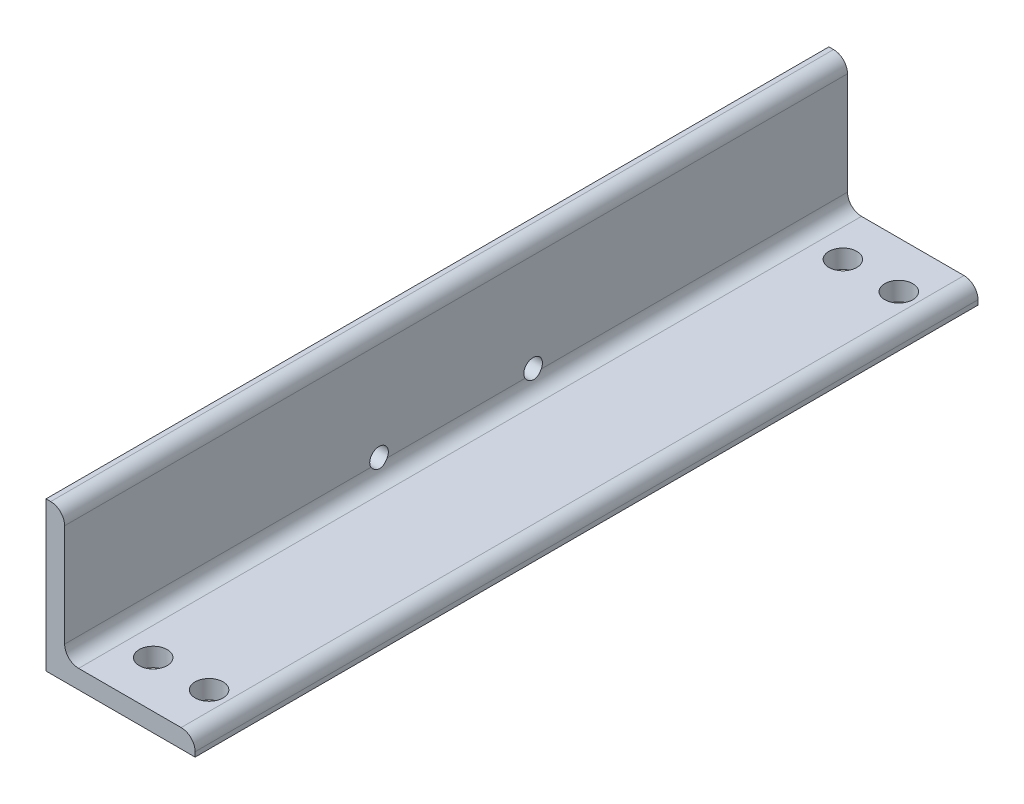
ISO-10303-21;
HEADER;
FILE_DESCRIPTION(('STEP AP214'),'2;1');
FILE_NAME('part.step','',(''),(''),'','','');
FILE_SCHEMA(('AUTOMOTIVE_DESIGN { 1 0 10303 214 1 1 1 1 }'));
ENDSEC;
DATA;
#1=APPLICATION_CONTEXT('core data for automotive mechanical design processes');
#2=APPLICATION_PROTOCOL_DEFINITION('international standard','automotive_design',2000,#1);
#3=PRODUCT_CONTEXT('',#1,'mechanical');
#4=PRODUCT('Part','Part','',(#3));
#5=PRODUCT_RELATED_PRODUCT_CATEGORY('part','',(#4));
#6=PRODUCT_DEFINITION_FORMATION('','',#4);
#7=PRODUCT_DEFINITION_CONTEXT('part definition',#1,'design');
#8=PRODUCT_DEFINITION('design','',#6,#7);
#9=PRODUCT_DEFINITION_SHAPE('','',#8);
#10=(LENGTH_UNIT() NAMED_UNIT(*) SI_UNIT(.MILLI.,.METRE.));
#11=(NAMED_UNIT(*) PLANE_ANGLE_UNIT() SI_UNIT($,.RADIAN.));
#12=(NAMED_UNIT(*) SI_UNIT($,.STERADIAN.) SOLID_ANGLE_UNIT());
#13=UNCERTAINTY_MEASURE_WITH_UNIT(LENGTH_MEASURE(1.E-05),#10,'distance_accuracy_value','');
#14=(GEOMETRIC_REPRESENTATION_CONTEXT(3) GLOBAL_UNCERTAINTY_ASSIGNED_CONTEXT((#13)) GLOBAL_UNIT_ASSIGNED_CONTEXT((#10,
#11,#12)) REPRESENTATION_CONTEXT('',''));
#15=CARTESIAN_POINT('',(0.,0.,0.));
#16=DIRECTION('',(0.,0.,1.));
#17=DIRECTION('',(1.,0.,0.));
#18=AXIS2_PLACEMENT_3D('',#15,#16,#17);
#19=CARTESIAN_POINT('',(101.6,0.,266.7));
#20=DIRECTION('',(0.,1.,0.));
#21=DIRECTION('',(-1.,0.,0.));
#22=AXIS2_PLACEMENT_3D('',#19,#20,#21);
#23=PLANE('',#22);
#24=CARTESIAN_POINT('',(79.375,0.,-234.95));
#25=DIRECTION('',(0.,1.,0.));
#26=DIRECTION('',(-1.,0.,0.));
#27=AXIS2_PLACEMENT_3D('',#24,#25,#26);
#28=CIRCLE('',#27,9.525);
#29=CARTESIAN_POINT('',(69.85,0.,-234.95));
#30=VERTEX_POINT('',#29);
#31=EDGE_CURVE('E195',#30,#30,#28,.F.);
#32=ORIENTED_EDGE('',*,*,#31,.F.);
#33=EDGE_LOOP('',(#32));
#34=FACE_BOUND('',#33,.T.);
#35=CARTESIAN_POINT('',(79.375,0.,234.95));
#36=DIRECTION('',(0.,1.,0.));
#37=DIRECTION('',(-1.,0.,0.));
#38=AXIS2_PLACEMENT_3D('',#35,#36,#37);
#39=CIRCLE('',#38,9.525);
#40=CARTESIAN_POINT('',(69.85,0.,234.95));
#41=VERTEX_POINT('',#40);
#42=EDGE_CURVE('E189',#41,#41,#39,.F.);
#43=ORIENTED_EDGE('',*,*,#42,.F.);
#44=EDGE_LOOP('',(#43));
#45=FACE_BOUND('',#44,.T.);
#46=CARTESIAN_POINT('',(41.275,0.,234.95));
#47=DIRECTION('',(0.,1.,0.));
#48=DIRECTION('',(-1.,0.,0.));
#49=AXIS2_PLACEMENT_3D('',#46,#47,#48);
#50=CIRCLE('',#49,9.525);
#51=CARTESIAN_POINT('',(31.75,0.,234.95));
#52=VERTEX_POINT('',#51);
#53=EDGE_CURVE('E183',#52,#52,#50,.F.);
#54=ORIENTED_EDGE('',*,*,#53,.F.);
#55=EDGE_LOOP('',(#54));
#56=FACE_BOUND('',#55,.T.);
#57=CARTESIAN_POINT('',(41.275,0.,-234.95));
#58=DIRECTION('',(0.,1.,0.));
#59=DIRECTION('',(-1.,0.,0.));
#60=AXIS2_PLACEMENT_3D('',#57,#58,#59);
#61=CIRCLE('',#60,9.525);
#62=CARTESIAN_POINT('',(31.75,0.,-234.95));
#63=VERTEX_POINT('',#62);
#64=EDGE_CURVE('E161',#63,#63,#61,.F.);
#65=ORIENTED_EDGE('',*,*,#64,.F.);
#66=EDGE_LOOP('',(#65));
#67=FACE_BOUND('',#66,.T.);
#68=DIRECTION('',(1.,0.,0.));
#69=VECTOR('',#68,1.);
#70=CARTESIAN_POINT('',(101.6,0.,-266.7));
#71=LINE('',#70,#69);
#72=CARTESIAN_POINT('',(0.,0.,-266.7));
#73=VERTEX_POINT('',#72);
#74=CARTESIAN_POINT('',(101.6,0.,-266.7));
#75=VERTEX_POINT('',#74);
#76=EDGE_CURVE('E158',#73,#75,#71,.T.);
#77=ORIENTED_EDGE('',*,*,#76,.T.);
#78=DIRECTION('',(0.,0.,-1.));
#79=VECTOR('',#78,1.);
#80=CARTESIAN_POINT('',(101.6,0.,266.7));
#81=LINE('',#80,#79);
#82=CARTESIAN_POINT('',(101.6,0.,266.7));
#83=VERTEX_POINT('',#82);
#84=EDGE_CURVE('E11',#83,#75,#81,.T.);
#85=ORIENTED_EDGE('',*,*,#84,.F.);
#86=DIRECTION('',(1.,0.,0.));
#87=VECTOR('',#86,1.);
#88=CARTESIAN_POINT('',(101.6,0.,266.7));
#89=LINE('',#88,#87);
#90=CARTESIAN_POINT('',(0.,0.,266.7));
#91=VERTEX_POINT('',#90);
#92=EDGE_CURVE('E143',#91,#83,#89,.T.);
#93=ORIENTED_EDGE('',*,*,#92,.F.);
#94=DIRECTION('',(0.,0.,-1.));
#95=VECTOR('',#94,1.);
#96=CARTESIAN_POINT('',(0.,0.,266.7));
#97=LINE('',#96,#95);
#98=EDGE_CURVE('E137',#91,#73,#97,.T.);
#99=ORIENTED_EDGE('',*,*,#98,.T.);
#100=EDGE_LOOP('',(#77,#85,#93,#99));
#101=FACE_BOUND('',#100,.T.);
#102=ADVANCED_FACE('F17',(#34,#45,#56,#67,#101),#23,.F.);
#103=CARTESIAN_POINT('',(101.6,3.18008,266.7));
#104=DIRECTION('',(-1.,0.,0.));
#105=DIRECTION('',(0.,0.,1.));
#106=AXIS2_PLACEMENT_3D('',#103,#104,#105);
#107=PLANE('',#106);
#108=DIRECTION('',(0.,1.,0.));
#109=VECTOR('',#108,1.);
#110=CARTESIAN_POINT('',(101.6,3.18008,-266.7));
#111=LINE('',#110,#109);
#112=CARTESIAN_POINT('',(101.6,3.18008,-266.7));
#113=VERTEX_POINT('',#112);
#114=EDGE_CURVE('E156',#75,#113,#111,.T.);
#115=ORIENTED_EDGE('',*,*,#114,.T.);
#116=DIRECTION('',(0.,0.,-1.));
#117=VECTOR('',#116,1.);
#118=CARTESIAN_POINT('',(101.6,3.18008,266.7));
#119=LINE('',#118,#117);
#120=CARTESIAN_POINT('',(101.6,3.18008,266.7));
#121=VERTEX_POINT('',#120);
#122=EDGE_CURVE('E24',#121,#113,#119,.T.);
#123=ORIENTED_EDGE('',*,*,#122,.F.);
#124=DIRECTION('',(0.,1.,0.));
#125=VECTOR('',#124,1.);
#126=CARTESIAN_POINT('',(101.6,3.18008,266.7));
#127=LINE('',#126,#125);
#128=EDGE_CURVE('E174',#83,#121,#127,.T.);
#129=ORIENTED_EDGE('',*,*,#128,.F.);
#130=ORIENTED_EDGE('',*,*,#84,.T.);
#131=EDGE_LOOP('',(#115,#123,#129,#130));
#132=FACE_BOUND('',#131,.T.);
#133=ADVANCED_FACE('F253',(#132),#107,.F.);
#134=CARTESIAN_POINT('',(92.08008,3.18008,266.7));
#135=DIRECTION('',(0.,0.,-1.));
#136=DIRECTION('',(-1.,0.,0.));
#137=AXIS2_PLACEMENT_3D('',#134,#135,#136);
#138=CYLINDRICAL_SURFACE('',#137,9.51992);
#139=CARTESIAN_POINT('',(92.08008,3.18008,-266.7));
#140=DIRECTION('',(0.,0.,1.));
#141=DIRECTION('',(1.,0.,0.));
#142=AXIS2_PLACEMENT_3D('',#139,#140,#141);
#143=CIRCLE('',#142,9.51992);
#144=CARTESIAN_POINT('',(92.08008,12.7,-266.7));
#145=VERTEX_POINT('',#144);
#146=EDGE_CURVE('E154',#113,#145,#143,.T.);
#147=ORIENTED_EDGE('',*,*,#146,.T.);
#148=DIRECTION('',(0.,0.,-1.));
#149=VECTOR('',#148,1.);
#150=CARTESIAN_POINT('',(92.08008,12.7,266.7));
#151=LINE('',#150,#149);
#152=CARTESIAN_POINT('',(92.08008,12.7,266.7));
#153=VERTEX_POINT('',#152);
#154=EDGE_CURVE('E120',#153,#145,#151,.T.);
#155=ORIENTED_EDGE('',*,*,#154,.F.);
#156=CARTESIAN_POINT('',(92.08008,3.18008,266.7));
#157=DIRECTION('',(0.,0.,1.));
#158=DIRECTION('',(1.,0.,0.));
#159=AXIS2_PLACEMENT_3D('',#156,#157,#158);
#160=CIRCLE('',#159,9.51992);
#161=EDGE_CURVE('E172',#121,#153,#160,.T.);
#162=ORIENTED_EDGE('',*,*,#161,.F.);
#163=ORIENTED_EDGE('',*,*,#122,.T.);
#164=EDGE_LOOP('',(#147,#155,#162,#163));
#165=FACE_BOUND('',#164,.T.);
#166=ADVANCED_FACE('F249',(#165),#138,.T.);
#167=CARTESIAN_POINT('',(22.225,12.7,266.7));
#168=DIRECTION('',(0.,-1.,0.));
#169=DIRECTION('',(1.,0.,0.));
#170=AXIS2_PLACEMENT_3D('',#167,#168,#169);
#171=PLANE('',#170);
#172=CARTESIAN_POINT('',(79.375,12.7,-234.95));
#173=DIRECTION('',(0.,1.,0.));
#174=DIRECTION('',(1.,0.,0.));
#175=AXIS2_PLACEMENT_3D('',#172,#173,#174);
#176=CIRCLE('',#175,9.525);
#177=CARTESIAN_POINT('',(88.9,12.7,-234.95));
#178=VERTEX_POINT('',#177);
#179=EDGE_CURVE('E198',#178,#178,#176,.T.);
#180=ORIENTED_EDGE('',*,*,#179,.F.);
#181=EDGE_LOOP('',(#180));
#182=FACE_BOUND('',#181,.T.);
#183=CARTESIAN_POINT('',(79.375,12.7,234.95));
#184=DIRECTION('',(0.,1.,0.));
#185=DIRECTION('',(-1.,0.,0.));
#186=AXIS2_PLACEMENT_3D('',#183,#184,#185);
#187=CIRCLE('',#186,9.525);
#188=CARTESIAN_POINT('',(69.85,12.7,234.95));
#189=VERTEX_POINT('',#188);
#190=EDGE_CURVE('E192',#189,#189,#187,.T.);
#191=ORIENTED_EDGE('',*,*,#190,.F.);
#192=EDGE_LOOP('',(#191));
#193=FACE_BOUND('',#192,.T.);
#194=CARTESIAN_POINT('',(41.275,12.7,234.95));
#195=DIRECTION('',(0.,1.,0.));
#196=DIRECTION('',(1.,0.,0.));
#197=AXIS2_PLACEMENT_3D('',#194,#195,#196);
#198=CIRCLE('',#197,9.525);
#199=CARTESIAN_POINT('',(50.8,12.7,234.95));
#200=VERTEX_POINT('',#199);
#201=EDGE_CURVE('E186',#200,#200,#198,.T.);
#202=ORIENTED_EDGE('',*,*,#201,.F.);
#203=EDGE_LOOP('',(#202));
#204=FACE_BOUND('',#203,.T.);
#205=CARTESIAN_POINT('',(41.275,12.7,-234.95));
#206=DIRECTION('',(0.,1.,0.));
#207=DIRECTION('',(-1.,0.,0.));
#208=AXIS2_PLACEMENT_3D('',#205,#206,#207);
#209=CIRCLE('',#208,9.525);
#210=CARTESIAN_POINT('',(31.75,12.7,-234.95));
#211=VERTEX_POINT('',#210);
#212=EDGE_CURVE('E180',#211,#211,#209,.T.);
#213=ORIENTED_EDGE('',*,*,#212,.F.);
#214=EDGE_LOOP('',(#213));
#215=FACE_BOUND('',#214,.T.);
#216=DIRECTION('',(-1.,0.,0.));
#217=VECTOR('',#216,1.);
#218=CARTESIAN_POINT('',(22.225,12.7,-266.7));
#219=LINE('',#218,#217);
#220=CARTESIAN_POINT('',(22.225,12.7,-266.7));
#221=VERTEX_POINT('',#220);
#222=EDGE_CURVE('E152',#145,#221,#219,.T.);
#223=ORIENTED_EDGE('',*,*,#222,.T.);
#224=DIRECTION('',(0.,0.,-1.));
#225=VECTOR('',#224,1.);
#226=CARTESIAN_POINT('',(22.225,12.7,266.7));
#227=LINE('',#226,#225);
#228=CARTESIAN_POINT('',(22.225,12.7,266.7));
#229=VERTEX_POINT('',#228);
#230=EDGE_CURVE('E116',#229,#221,#227,.T.);
#231=ORIENTED_EDGE('',*,*,#230,.F.);
#232=DIRECTION('',(-1.,0.,0.));
#233=VECTOR('',#232,1.);
#234=CARTESIAN_POINT('',(22.225,12.7,266.7));
#235=LINE('',#234,#233);
#236=EDGE_CURVE('E170',#153,#229,#235,.T.);
#237=ORIENTED_EDGE('',*,*,#236,.F.);
#238=ORIENTED_EDGE('',*,*,#154,.T.);
#239=EDGE_LOOP('',(#223,#231,#237,#238));
#240=FACE_BOUND('',#239,.T.);
#241=ADVANCED_FACE('F245',(#182,#193,#204,#215,#240),#171,.F.);
#242=CARTESIAN_POINT('',(22.225,22.225,266.7));
#243=DIRECTION('',(0.,0.,-1.));
#244=DIRECTION('',(-1.,0.,0.));
#245=AXIS2_PLACEMENT_3D('',#242,#243,#244);
#246=CYLINDRICAL_SURFACE('',#245,9.525);
#247=DIRECTION('',(0.,0.,-1.));
#248=VECTOR('',#247,1.);
#249=CARTESIAN_POINT('',(12.7,22.225,266.7));
#250=LINE('',#249,#248);
#251=CARTESIAN_POINT('',(12.7,22.225,46.9898386859688));
#252=VERTEX_POINT('',#251);
#253=CARTESIAN_POINT('',(12.7,22.225,-46.9898386859688));
#254=VERTEX_POINT('',#253);
#255=EDGE_CURVE('E110',#252,#254,#250,.T.);
#256=ORIENTED_EDGE('',*,*,#255,.F.);
#257=CARTESIAN_POINT('',(12.7,22.225,57.9883613140312));
#258=CARTESIAN_POINT('',(12.6999827797198,22.073747023169,57.9010652201356));
#259=CARTESIAN_POINT('',(12.7036020266311,21.9261666695694,57.8075126623455));
#260=CARTESIAN_POINT('',(12.7169364482523,21.6394724254637,57.6087916880467));
#261=CARTESIAN_POINT('',(12.7266475791581,21.5003529857331,57.5036310151549));
#262=CARTESIAN_POINT('',(12.750958155591,21.2318706006449,57.2827790052492));
#263=CARTESIAN_POINT('',(12.7655439948094,21.1024817133119,57.1671176251949));
#264=CARTESIAN_POINT('',(12.798377928773,20.8538152379376,56.9258460242172));
#265=CARTESIAN_POINT('',(12.8166265898387,20.7345392175398,56.8002342666547));
#266=CARTESIAN_POINT('',(12.8554966806538,20.5070584428926,56.540198978187));
#267=CARTESIAN_POINT('',(12.8761128381699,20.3988300647512,56.4057953030353));
#268=CARTESIAN_POINT('',(12.9185263814264,20.1937077958268,56.1287078060163));
#269=CARTESIAN_POINT('',(12.9403241689367,20.0968177960641,55.9860211666475));
#270=CARTESIAN_POINT('',(12.9839042072899,19.9149071167127,55.6931579148723));
#271=CARTESIAN_POINT('',(13.0056864428088,19.8298930504997,55.5429771918946));
#272=CARTESIAN_POINT('',(13.0480696077046,19.6723085952029,55.2360634666354));
#273=CARTESIAN_POINT('',(13.0686705459691,19.5997381124906,55.0793305136655));
#274=CARTESIAN_POINT('',(13.1084371762002,19.4647334353171,54.7534986760388));
#275=CARTESIAN_POINT('',(13.1275058271347,19.4028551354978,54.5841570080991));
#276=CARTESIAN_POINT('',(13.1621000716123,19.2936601731414,54.2405554814189));
#277=CARTESIAN_POINT('',(13.1776270141683,19.2463379638851,54.0662975237747));
#278=CARTESIAN_POINT('',(13.2042460989573,19.1666685130754,53.7141143642797));
#279=CARTESIAN_POINT('',(13.2153397547297,19.134316160165,53.5361904358562));
#280=CARTESIAN_POINT('',(13.2324460824723,19.0848905322721,53.1779933638632));
#281=CARTESIAN_POINT('',(13.2384590349304,19.0678164138286,52.9977203505363));
#282=CARTESIAN_POINT('',(13.2449047015103,19.0495315458891,52.6441047809365));
#283=CARTESIAN_POINT('',(13.2455676813632,19.0476661661744,52.4707999822137));
#284=CARTESIAN_POINT('',(13.2418817508243,19.058102036211,52.1246741779014));
#285=CARTESIAN_POINT('',(13.2375329652902,19.0704029330389,51.9518531603668));
#286=CARTESIAN_POINT('',(13.2240617329295,19.1090488693273,51.6079804584642));
#287=CARTESIAN_POINT('',(13.2149392563347,19.1353939963659,51.4369287851363));
#288=CARTESIAN_POINT('',(13.1924145874921,19.2018799599007,51.097818829635));
#289=CARTESIAN_POINT('',(13.179012369901,19.2420208780908,50.9297605651938));
#290=CARTESIAN_POINT('',(13.1489414832537,19.3348245533895,50.6010485624637));
#291=CARTESIAN_POINT('',(13.1323423995837,19.3872249217998,50.4403141695282));
#292=CARTESIAN_POINT('',(13.09654646157,19.5045731325473,50.1237351278395));
#293=CARTESIAN_POINT('',(13.0773487466099,19.5695251348039,49.9678921201718));
#294=CARTESIAN_POINT('',(13.0373033169677,19.7115759448712,49.6619466657816));
#295=CARTESIAN_POINT('',(13.0164545660346,19.7886824118256,49.5118479134289));
#296=CARTESIAN_POINT('',(12.9741618627834,19.9545503138604,49.2183206012311));
#297=CARTESIAN_POINT('',(12.9527178920628,20.0433121096079,49.0748922479836));
#298=CARTESIAN_POINT('',(12.9091267176458,20.2373942526399,48.7875116740178));
#299=CARTESIAN_POINT('',(12.8870092961105,20.3433707692314,48.6439973630534));
#300=CARTESIAN_POINT('',(12.8446977357167,20.5671365603043,48.3662709902861));
#301=CARTESIAN_POINT('',(12.8245029073061,20.684921568229,48.2320555980955));
#302=CARTESIAN_POINT('',(12.7874276417262,20.9314165936432,47.9740092378239));
#303=CARTESIAN_POINT('',(12.770541517766,21.0601073117669,47.8501606656117));
#304=CARTESIAN_POINT('',(12.7414041834692,21.3277095254071,47.613567490968));
#305=CARTESIAN_POINT('',(12.7291502409881,21.4666149381728,47.5008163721771));
#306=CARTESIAN_POINT('',(12.7134994081993,21.7085613726005,47.3208477880985));
#307=CARTESIAN_POINT('',(12.7085293033237,21.8091554322337,47.2504558963998));
#308=CARTESIAN_POINT('',(12.7017790449912,22.0142331751443,47.1156334058616));
#309=CARTESIAN_POINT('',(12.6999960275457,22.1187132800441,47.051197504272));
#310=CARTESIAN_POINT('',(12.7,22.225,46.9898386859688));
#311=B_SPLINE_CURVE_WITH_KNOTS('',3,(#257,#258,#259,#260,#261,#262,#263,#264,#265,#266,#267,
#268,#269,#270,#271,#272,#273,#274,#275,#276,#277,#278,#279,#280,#281,#282,#283,#284,#285,#286,
#287,#288,#289,#290,#291,#292,#293,#294,#295,#296,#297,#298,#299,#300,#301,#302,#303,#304,#305,
#306,#307,#308,#309,#310),.UNSPECIFIED.,.F.,.F.,(4,2,2,2,2,2,2,2,2,2,2,2,2,2,2,2,2,2,2,2,2,2,2,
2,2,2,4),(0.,0.523647527244092,1.04694782355641,1.56879951356917,2.09073195095311,
2.61152383605138,3.13249392175966,3.65375297441763,4.17500810482934,4.71822515052255,
5.26123494167952,5.80405918872557,6.34685346638268,6.86615386676682,7.38544133013575,
7.90473203175343,8.42402580848563,8.93308470454927,9.4423126054699,9.95186268900613,
10.4614285439838,11.0000966296267,11.5385707843629,12.0761111655917,12.6133339992296,
12.9817344318086,13.3498036447117),.UNSPECIFIED.);
#312=CARTESIAN_POINT('',(12.7,22.225,57.9883613140312));
#313=VERTEX_POINT('',#312);
#314=EDGE_CURVE('E30',#313,#252,#311,.T.);
#315=ORIENTED_EDGE('',*,*,#314,.F.);
#316=CARTESIAN_POINT('',(12.7,22.225,266.7));
#317=VERTEX_POINT('',#316);
#318=EDGE_CURVE('E108',#317,#313,#250,.T.);
#319=ORIENTED_EDGE('',*,*,#318,.F.);
#320=CARTESIAN_POINT('',(22.225,22.225,266.7));
#321=DIRECTION('',(0.,0.,-1.));
#322=DIRECTION('',(-1.,0.,0.));
#323=AXIS2_PLACEMENT_3D('',#320,#321,#322);
#324=CIRCLE('',#323,9.525);
#325=EDGE_CURVE('E168',#229,#317,#324,.T.);
#326=ORIENTED_EDGE('',*,*,#325,.F.);
#327=ORIENTED_EDGE('',*,*,#230,.T.);
#328=CARTESIAN_POINT('',(22.225,22.225,-266.7));
#329=DIRECTION('',(0.,0.,-1.));
#330=DIRECTION('',(-1.,0.,0.));
#331=AXIS2_PLACEMENT_3D('',#328,#329,#330);
#332=CIRCLE('',#331,9.525);
#333=CARTESIAN_POINT('',(12.7,22.225,-266.7));
#334=VERTEX_POINT('',#333);
#335=EDGE_CURVE('E150',#221,#334,#332,.T.);
#336=ORIENTED_EDGE('',*,*,#335,.T.);
#337=CARTESIAN_POINT('',(12.7,22.225,-57.9883613140312));
#338=VERTEX_POINT('',#337);
#339=EDGE_CURVE('E118',#338,#334,#250,.T.);
#340=ORIENTED_EDGE('',*,*,#339,.F.);
#341=CARTESIAN_POINT('',(12.7,22.225,-46.9898386859688));
#342=CARTESIAN_POINT('',(12.6999827797198,22.073747023169,-47.0771347798644));
#343=CARTESIAN_POINT('',(12.7036020266311,21.9261666695694,-47.1706873376545));
#344=CARTESIAN_POINT('',(12.7169364482523,21.6394724254637,-47.3694083119533));
#345=CARTESIAN_POINT('',(12.7266475791581,21.5003529857331,-47.4745689848451));
#346=CARTESIAN_POINT('',(12.750958155591,21.2318706006448,-47.6954209947509));
#347=CARTESIAN_POINT('',(12.7655439948094,21.1024817133119,-47.8110823748051));
#348=CARTESIAN_POINT('',(12.798377928773,20.8538152379376,-48.0523539757828));
#349=CARTESIAN_POINT('',(12.8166265898388,20.7345392175398,-48.1779657333453));
#350=CARTESIAN_POINT('',(12.8554966806538,20.5070584428925,-48.438001021813));
#351=CARTESIAN_POINT('',(12.87611283817,20.3988300647512,-48.5724046969647));
#352=CARTESIAN_POINT('',(12.9185263814264,20.1937077958268,-48.8494921939837));
#353=CARTESIAN_POINT('',(12.9403241689368,20.0968177960641,-48.9921788333525));
#354=CARTESIAN_POINT('',(12.9839042072899,19.9149071167127,-49.2850420851278));
#355=CARTESIAN_POINT('',(13.0056864428088,19.8298930504997,-49.4352228081054));
#356=CARTESIAN_POINT('',(13.0480696077046,19.6723085952028,-49.7421365333646));
#357=CARTESIAN_POINT('',(13.0686705459691,19.5997381124906,-49.8988694863345));
#358=CARTESIAN_POINT('',(13.1084371762002,19.4647334353171,-50.2247013239612));
#359=CARTESIAN_POINT('',(13.1275058271347,19.4028551354978,-50.3940429919009));
#360=CARTESIAN_POINT('',(13.1621000716123,19.2936601731414,-50.7376445185811));
#361=CARTESIAN_POINT('',(13.1776270141683,19.2463379638851,-50.9119024762253));
#362=CARTESIAN_POINT('',(13.2042460989573,19.1666685130754,-51.2640856357203));
#363=CARTESIAN_POINT('',(13.2153397547297,19.134316160165,-51.4420095641438));
#364=CARTESIAN_POINT('',(13.2324460824723,19.0848905322721,-51.8002066361368));
#365=CARTESIAN_POINT('',(13.2384590349304,19.0678164138286,-51.9804796494637));
#366=CARTESIAN_POINT('',(13.2449047015103,19.0495315458891,-52.3340952190635));
#367=CARTESIAN_POINT('',(13.2455676813632,19.0476661661744,-52.5074000177863));
#368=CARTESIAN_POINT('',(13.2418817508243,19.0581020362111,-52.8535258220986));
#369=CARTESIAN_POINT('',(13.2375329652902,19.0704029330389,-53.0263468396332));
#370=CARTESIAN_POINT('',(13.2240617329295,19.1090488693273,-53.3702195415358));
#371=CARTESIAN_POINT('',(13.2149392563347,19.1353939963659,-53.5412712148637));
#372=CARTESIAN_POINT('',(13.1924145874921,19.2018799599007,-53.880381170365));
#373=CARTESIAN_POINT('',(13.179012369901,19.2420208780907,-54.0484394348062));
#374=CARTESIAN_POINT('',(13.1489414832537,19.3348245533895,-54.3771514375363));
#375=CARTESIAN_POINT('',(13.1323423995837,19.3872249217998,-54.5378858304718));
#376=CARTESIAN_POINT('',(13.09654646157,19.5045731325473,-54.8544648721604));
#377=CARTESIAN_POINT('',(13.0773487466099,19.5695251348039,-55.0103078798282));
#378=CARTESIAN_POINT('',(13.0373033169677,19.7115759448712,-55.3162533342184));
#379=CARTESIAN_POINT('',(13.0164545660346,19.7886824118256,-55.4663520865711));
#380=CARTESIAN_POINT('',(12.9741618627834,19.9545503138604,-55.7598793987689));
#381=CARTESIAN_POINT('',(12.9527178920628,20.0433121096079,-55.9033077520164));
#382=CARTESIAN_POINT('',(12.9091267176458,20.2373942526399,-56.1906883259822));
#383=CARTESIAN_POINT('',(12.8870092961105,20.3433707692314,-56.3342026369466));
#384=CARTESIAN_POINT('',(12.8446977357167,20.5671365603043,-56.6119290097139));
#385=CARTESIAN_POINT('',(12.8245029073061,20.684921568229,-56.7461444019045));
#386=CARTESIAN_POINT('',(12.7874276417262,20.9314165936432,-57.0041907621761));
#387=CARTESIAN_POINT('',(12.770541517766,21.0601073117669,-57.1280393343883));
#388=CARTESIAN_POINT('',(12.7414041834692,21.3277095254071,-57.364632509032));
#389=CARTESIAN_POINT('',(12.7291502409881,21.4666149381728,-57.4773836278229));
#390=CARTESIAN_POINT('',(12.7134994081993,21.7085613726005,-57.6573522119015));
#391=CARTESIAN_POINT('',(12.7085293033237,21.8091554322337,-57.7277441036002));
#392=CARTESIAN_POINT('',(12.7017790449912,22.0142331751444,-57.8625665941384));
#393=CARTESIAN_POINT('',(12.6999960275457,22.1187132800441,-57.927002495728));
#394=CARTESIAN_POINT('',(12.7,22.225,-57.9883613140312));
#395=B_SPLINE_CURVE_WITH_KNOTS('',3,(#341,#342,#343,#344,#345,#346,#347,#348,#349,#350,#351,
#352,#353,#354,#355,#356,#357,#358,#359,#360,#361,#362,#363,#364,#365,#366,#367,#368,#369,#370,
#371,#372,#373,#374,#375,#376,#377,#378,#379,#380,#381,#382,#383,#384,#385,#386,#387,#388,#389,
#390,#391,#392,#393,#394),.UNSPECIFIED.,.F.,.F.,(4,2,2,2,2,2,2,2,2,2,2,2,2,2,2,2,2,2,2,2,2,2,2,
2,2,2,4),(0.,0.523647527244111,1.04694782355644,1.5687995135692,2.09073195095315,
2.61152383605141,3.13249392175969,3.65375297441764,4.17500810482935,4.71822515052257,
5.26123494167953,5.80405918872559,6.34685346638269,6.86615386676682,7.38544133013575,
7.90473203175344,8.42402580848563,8.93308470454928,9.4423126054699,9.95186268900614,
10.4614285439838,11.0000966296267,11.5385707843629,12.0761111655917,12.6133339992296,
12.9817344318086,13.3498036447117),.UNSPECIFIED.);
#396=EDGE_CURVE('E37',#254,#338,#395,.T.);
#397=ORIENTED_EDGE('',*,*,#396,.F.);
#398=EDGE_LOOP('',(#256,#315,#319,#326,#327,#336,#340,#397));
#399=FACE_BOUND('',#398,.T.);
#400=ADVANCED_FACE('F106',(#399),#246,.F.);
#401=CARTESIAN_POINT('',(12.7,92.08008,266.7));
#402=DIRECTION('',(-1.,0.,0.));
#403=DIRECTION('',(0.,-1.,0.));
#404=AXIS2_PLACEMENT_3D('',#401,#402,#403);
#405=PLANE('',#404);
#406=ORIENTED_EDGE('',*,*,#318,.T.);
#407=CARTESIAN_POINT('',(12.7,25.4,52.4891));
#408=DIRECTION('',(-1.,0.,0.));
#409=DIRECTION('',(0.,-1.,0.));
#410=AXIS2_PLACEMENT_3D('',#407,#408,#409);
#411=CIRCLE('',#410,6.35);
#412=EDGE_CURVE('E97',#252,#313,#411,.F.);
#413=ORIENTED_EDGE('',*,*,#412,.F.);
#414=ORIENTED_EDGE('',*,*,#255,.T.);
#415=CARTESIAN_POINT('',(12.7,25.4,-52.4891));
#416=DIRECTION('',(-1.,0.,0.));
#417=DIRECTION('',(0.,-1.,0.));
#418=AXIS2_PLACEMENT_3D('',#415,#416,#417);
#419=CIRCLE('',#418,6.35);
#420=EDGE_CURVE('E207',#338,#254,#419,.F.);
#421=ORIENTED_EDGE('',*,*,#420,.F.);
#422=ORIENTED_EDGE('',*,*,#339,.T.);
#423=DIRECTION('',(0.,1.,0.));
#424=VECTOR('',#423,1.);
#425=CARTESIAN_POINT('',(12.7,92.08008,-266.7));
#426=LINE('',#425,#424);
#427=CARTESIAN_POINT('',(12.7,92.08008,-266.7));
#428=VERTEX_POINT('',#427);
#429=EDGE_CURVE('E148',#334,#428,#426,.T.);
#430=ORIENTED_EDGE('',*,*,#429,.T.);
#431=DIRECTION('',(0.,0.,-1.));
#432=VECTOR('',#431,1.);
#433=CARTESIAN_POINT('',(12.7,92.08008,266.7));
#434=LINE('',#433,#432);
#435=CARTESIAN_POINT('',(12.7,92.08008,266.7));
#436=VERTEX_POINT('',#435);
#437=EDGE_CURVE('E123',#436,#428,#434,.T.);
#438=ORIENTED_EDGE('',*,*,#437,.F.);
#439=DIRECTION('',(0.,1.,0.));
#440=VECTOR('',#439,1.);
#441=CARTESIAN_POINT('',(12.7,92.08008,266.7));
#442=LINE('',#441,#440);
#443=EDGE_CURVE('E115',#317,#436,#442,.T.);
#444=ORIENTED_EDGE('',*,*,#443,.F.);
#445=EDGE_LOOP('',(#406,#413,#414,#421,#422,#430,#438,#444));
#446=FACE_BOUND('',#445,.T.);
#447=ADVANCED_FACE('F113',(#446),#405,.F.);
#448=CARTESIAN_POINT('',(3.18008,92.08008,266.7));
#449=DIRECTION('',(0.,0.,-1.));
#450=DIRECTION('',(-1.,0.,0.));
#451=AXIS2_PLACEMENT_3D('',#448,#449,#450);
#452=CYLINDRICAL_SURFACE('',#451,9.51992);
#453=CARTESIAN_POINT('',(3.18008,92.08008,-266.7));
#454=DIRECTION('',(0.,0.,1.));
#455=DIRECTION('',(-1.,0.,0.));
#456=AXIS2_PLACEMENT_3D('',#453,#454,#455);
#457=CIRCLE('',#456,9.51992);
#458=CARTESIAN_POINT('',(3.18008,101.6,-266.7));
#459=VERTEX_POINT('',#458);
#460=EDGE_CURVE('E146',#428,#459,#457,.T.);
#461=ORIENTED_EDGE('',*,*,#460,.T.);
#462=DIRECTION('',(0.,0.,-1.));
#463=VECTOR('',#462,1.);
#464=CARTESIAN_POINT('',(3.18008,101.6,266.7));
#465=LINE('',#464,#463);
#466=CARTESIAN_POINT('',(3.18008,101.6,266.7));
#467=VERTEX_POINT('',#466);
#468=EDGE_CURVE('E127',#467,#459,#465,.T.);
#469=ORIENTED_EDGE('',*,*,#468,.F.);
#470=CARTESIAN_POINT('',(3.18008,92.08008,266.7));
#471=DIRECTION('',(0.,0.,1.));
#472=DIRECTION('',(-1.,0.,0.));
#473=AXIS2_PLACEMENT_3D('',#470,#471,#472);
#474=CIRCLE('',#473,9.51992);
#475=EDGE_CURVE('E165',#436,#467,#474,.T.);
#476=ORIENTED_EDGE('',*,*,#475,.F.);
#477=ORIENTED_EDGE('',*,*,#437,.T.);
#478=EDGE_LOOP('',(#461,#469,#476,#477));
#479=FACE_BOUND('',#478,.T.);
#480=ADVANCED_FACE('F235',(#479),#452,.T.);
#481=CARTESIAN_POINT('',(0.,101.6,266.7));
#482=DIRECTION('',(0.,-1.,0.));
#483=DIRECTION('',(0.,0.,-1.));
#484=AXIS2_PLACEMENT_3D('',#481,#482,#483);
#485=PLANE('',#484);
#486=DIRECTION('',(-1.,0.,0.));
#487=VECTOR('',#486,1.);
#488=CARTESIAN_POINT('',(0.,101.6,-266.7));
#489=LINE('',#488,#487);
#490=CARTESIAN_POINT('',(0.,101.6,-266.7));
#491=VERTEX_POINT('',#490);
#492=EDGE_CURVE('E144',#459,#491,#489,.T.);
#493=ORIENTED_EDGE('',*,*,#492,.T.);
#494=DIRECTION('',(0.,0.,-1.));
#495=VECTOR('',#494,1.);
#496=CARTESIAN_POINT('',(0.,101.6,266.7));
#497=LINE('',#496,#495);
#498=CARTESIAN_POINT('',(0.,101.6,266.7));
#499=VERTEX_POINT('',#498);
#500=EDGE_CURVE('E132',#499,#491,#497,.T.);
#501=ORIENTED_EDGE('',*,*,#500,.F.);
#502=DIRECTION('',(-1.,0.,0.));
#503=VECTOR('',#502,1.);
#504=CARTESIAN_POINT('',(0.,101.6,266.7));
#505=LINE('',#504,#503);
#506=EDGE_CURVE('E163',#467,#499,#505,.T.);
#507=ORIENTED_EDGE('',*,*,#506,.F.);
#508=ORIENTED_EDGE('',*,*,#468,.T.);
#509=EDGE_LOOP('',(#493,#501,#507,#508));
#510=FACE_BOUND('',#509,.T.);
#511=ADVANCED_FACE('F263',(#510),#485,.F.);
#512=CARTESIAN_POINT('',(0.,0.,266.7));
#513=DIRECTION('',(1.,0.,0.));
#514=DIRECTION('',(0.,0.,-1.));
#515=AXIS2_PLACEMENT_3D('',#512,#513,#514);
#516=PLANE('',#515);
#517=CARTESIAN_POINT('',(0.,25.4,52.4891));
#518=DIRECTION('',(-1.,0.,0.));
#519=DIRECTION('',(0.,0.,1.));
#520=AXIS2_PLACEMENT_3D('',#517,#518,#519);
#521=CIRCLE('',#520,6.35);
#522=CARTESIAN_POINT('',(0.,25.4,58.8391));
#523=VERTEX_POINT('',#522);
#524=EDGE_CURVE('E102',#523,#523,#521,.T.);
#525=ORIENTED_EDGE('',*,*,#524,.F.);
#526=EDGE_LOOP('',(#525));
#527=FACE_BOUND('',#526,.T.);
#528=CARTESIAN_POINT('',(0.,25.4,-52.4891));
#529=DIRECTION('',(-1.,0.,0.));
#530=DIRECTION('',(0.,0.,1.));
#531=AXIS2_PLACEMENT_3D('',#528,#529,#530);
#532=CIRCLE('',#531,6.35);
#533=CARTESIAN_POINT('',(0.,25.4,-46.1391));
#534=VERTEX_POINT('',#533);
#535=EDGE_CURVE('E111',#534,#534,#532,.T.);
#536=ORIENTED_EDGE('',*,*,#535,.F.);
#537=EDGE_LOOP('',(#536));
#538=FACE_BOUND('',#537,.T.);
#539=DIRECTION('',(0.,-1.,0.));
#540=VECTOR('',#539,1.);
#541=CARTESIAN_POINT('',(0.,0.,-266.7));
#542=LINE('',#541,#540);
#543=EDGE_CURVE('E141',#491,#73,#542,.T.);
#544=ORIENTED_EDGE('',*,*,#543,.T.);
#545=ORIENTED_EDGE('',*,*,#98,.F.);
#546=DIRECTION('',(0.,-1.,0.));
#547=VECTOR('',#546,1.);
#548=CARTESIAN_POINT('',(0.,0.,266.7));
#549=LINE('',#548,#547);
#550=EDGE_CURVE('E140',#499,#91,#549,.T.);
#551=ORIENTED_EDGE('',*,*,#550,.F.);
#552=ORIENTED_EDGE('',*,*,#500,.T.);
#553=EDGE_LOOP('',(#544,#545,#551,#552));
#554=FACE_BOUND('',#553,.T.);
#555=ADVANCED_FACE('F260',(#527,#538,#554),#516,.F.);
#556=CARTESIAN_POINT('',(3.18008,92.08008,266.7));
#557=DIRECTION('',(0.,0.,-1.));
#558=DIRECTION('',(-1.,0.,0.));
#559=AXIS2_PLACEMENT_3D('',#556,#557,#558);
#560=PLANE('',#559);
#561=ORIENTED_EDGE('',*,*,#92,.T.);
#562=ORIENTED_EDGE('',*,*,#128,.T.);
#563=ORIENTED_EDGE('',*,*,#161,.T.);
#564=ORIENTED_EDGE('',*,*,#236,.T.);
#565=ORIENTED_EDGE('',*,*,#325,.T.);
#566=ORIENTED_EDGE('',*,*,#443,.T.);
#567=ORIENTED_EDGE('',*,*,#475,.T.);
#568=ORIENTED_EDGE('',*,*,#506,.T.);
#569=ORIENTED_EDGE('',*,*,#550,.T.);
#570=EDGE_LOOP('',(#561,#562,#563,#564,#565,#566,#567,#568,#569));
#571=FACE_BOUND('',#570,.T.);
#572=ADVANCED_FACE('F238',(#571),#560,.F.);
#573=CARTESIAN_POINT('',(3.18008,92.08008,-266.7));
#574=DIRECTION('',(0.,0.,-1.));
#575=DIRECTION('',(-1.,0.,0.));
#576=AXIS2_PLACEMENT_3D('',#573,#574,#575);
#577=PLANE('',#576);
#578=ORIENTED_EDGE('',*,*,#76,.F.);
#579=ORIENTED_EDGE('',*,*,#543,.F.);
#580=ORIENTED_EDGE('',*,*,#492,.F.);
#581=ORIENTED_EDGE('',*,*,#460,.F.);
#582=ORIENTED_EDGE('',*,*,#429,.F.);
#583=ORIENTED_EDGE('',*,*,#335,.F.);
#584=ORIENTED_EDGE('',*,*,#222,.F.);
#585=ORIENTED_EDGE('',*,*,#146,.F.);
#586=ORIENTED_EDGE('',*,*,#114,.F.);
#587=EDGE_LOOP('',(#578,#579,#580,#581,#582,#583,#584,#585,#586));
#588=FACE_BOUND('',#587,.T.);
#589=ADVANCED_FACE('F232',(#588),#577,.T.);
#590=CARTESIAN_POINT('',(41.275,-0.000999999999999265,-234.95));
#591=DIRECTION('',(0.,1.,0.));
#592=DIRECTION('',(-1.,0.,0.));
#593=AXIS2_PLACEMENT_3D('',#590,#591,#592);
#594=CYLINDRICAL_SURFACE('',#593,9.525);
#595=ORIENTED_EDGE('',*,*,#212,.T.);
#596=EDGE_LOOP('',(#595));
#597=FACE_BOUND('',#596,.T.);
#598=ORIENTED_EDGE('',*,*,#64,.T.);
#599=EDGE_LOOP('',(#598));
#600=FACE_BOUND('',#599,.T.);
#601=ADVANCED_FACE('F289',(#597,#600),#594,.F.);
#602=CARTESIAN_POINT('',(41.275,-0.000999999999999265,234.95));
#603=DIRECTION('',(0.,1.,0.));
#604=DIRECTION('',(-1.,0.,0.));
#605=AXIS2_PLACEMENT_3D('',#602,#603,#604);
#606=CYLINDRICAL_SURFACE('',#605,9.525);
#607=ORIENTED_EDGE('',*,*,#201,.T.);
#608=EDGE_LOOP('',(#607));
#609=FACE_BOUND('',#608,.T.);
#610=ORIENTED_EDGE('',*,*,#53,.T.);
#611=EDGE_LOOP('',(#610));
#612=FACE_BOUND('',#611,.T.);
#613=ADVANCED_FACE('F291',(#609,#612),#606,.F.);
#614=CARTESIAN_POINT('',(79.375,-0.001000000000001,234.95));
#615=DIRECTION('',(0.,1.,0.));
#616=DIRECTION('',(-1.,0.,0.));
#617=AXIS2_PLACEMENT_3D('',#614,#615,#616);
#618=CYLINDRICAL_SURFACE('',#617,9.525);
#619=ORIENTED_EDGE('',*,*,#190,.T.);
#620=EDGE_LOOP('',(#619));
#621=FACE_BOUND('',#620,.T.);
#622=ORIENTED_EDGE('',*,*,#42,.T.);
#623=EDGE_LOOP('',(#622));
#624=FACE_BOUND('',#623,.T.);
#625=ADVANCED_FACE('F299',(#621,#624),#618,.F.);
#626=CARTESIAN_POINT('',(79.375,-0.001000000000001,-234.95));
#627=DIRECTION('',(0.,1.,0.));
#628=DIRECTION('',(-1.,0.,0.));
#629=AXIS2_PLACEMENT_3D('',#626,#627,#628);
#630=CYLINDRICAL_SURFACE('',#629,9.525);
#631=ORIENTED_EDGE('',*,*,#179,.T.);
#632=EDGE_LOOP('',(#631));
#633=FACE_BOUND('',#632,.T.);
#634=ORIENTED_EDGE('',*,*,#31,.T.);
#635=EDGE_LOOP('',(#634));
#636=FACE_BOUND('',#635,.T.);
#637=ADVANCED_FACE('F340',(#633,#636),#630,.F.);
#638=CARTESIAN_POINT('',(101.601,25.4,-52.4891));
#639=DIRECTION('',(-1.,0.,0.));
#640=DIRECTION('',(0.,0.,1.));
#641=AXIS2_PLACEMENT_3D('',#638,#639,#640);
#642=CYLINDRICAL_SURFACE('',#641,6.35);
#643=ORIENTED_EDGE('',*,*,#535,.T.);
#644=EDGE_LOOP('',(#643));
#645=FACE_BOUND('',#644,.T.);
#646=ORIENTED_EDGE('',*,*,#396,.T.);
#647=ORIENTED_EDGE('',*,*,#420,.T.);
#648=EDGE_LOOP('',(#646,#647));
#649=FACE_BOUND('',#648,.T.);
#650=ADVANCED_FACE('F209',(#645,#649),#642,.F.);
#651=CARTESIAN_POINT('',(101.601,25.4,52.4891));
#652=DIRECTION('',(-1.,0.,0.));
#653=DIRECTION('',(0.,0.,1.));
#654=AXIS2_PLACEMENT_3D('',#651,#652,#653);
#655=CYLINDRICAL_SURFACE('',#654,6.35);
#656=ORIENTED_EDGE('',*,*,#524,.T.);
#657=EDGE_LOOP('',(#656));
#658=FACE_BOUND('',#657,.T.);
#659=ORIENTED_EDGE('',*,*,#314,.T.);
#660=ORIENTED_EDGE('',*,*,#412,.T.);
#661=EDGE_LOOP('',(#659,#660));
#662=FACE_BOUND('',#661,.T.);
#663=ADVANCED_FACE('F98',(#658,#662),#655,.F.);
#664=CLOSED_SHELL('',(#102,#133,#166,#241,#400,#447,#480,#511,#555,#572,#589,#601,#613,#625,
#637,#650,#663));
#665=MANIFOLD_SOLID_BREP('B1',#664);
#666=ADVANCED_BREP_SHAPE_REPRESENTATION('',(#18,#665),#14);
#667=SHAPE_DEFINITION_REPRESENTATION(#9,#666);
ENDSEC;
END-ISO-10303-21;
